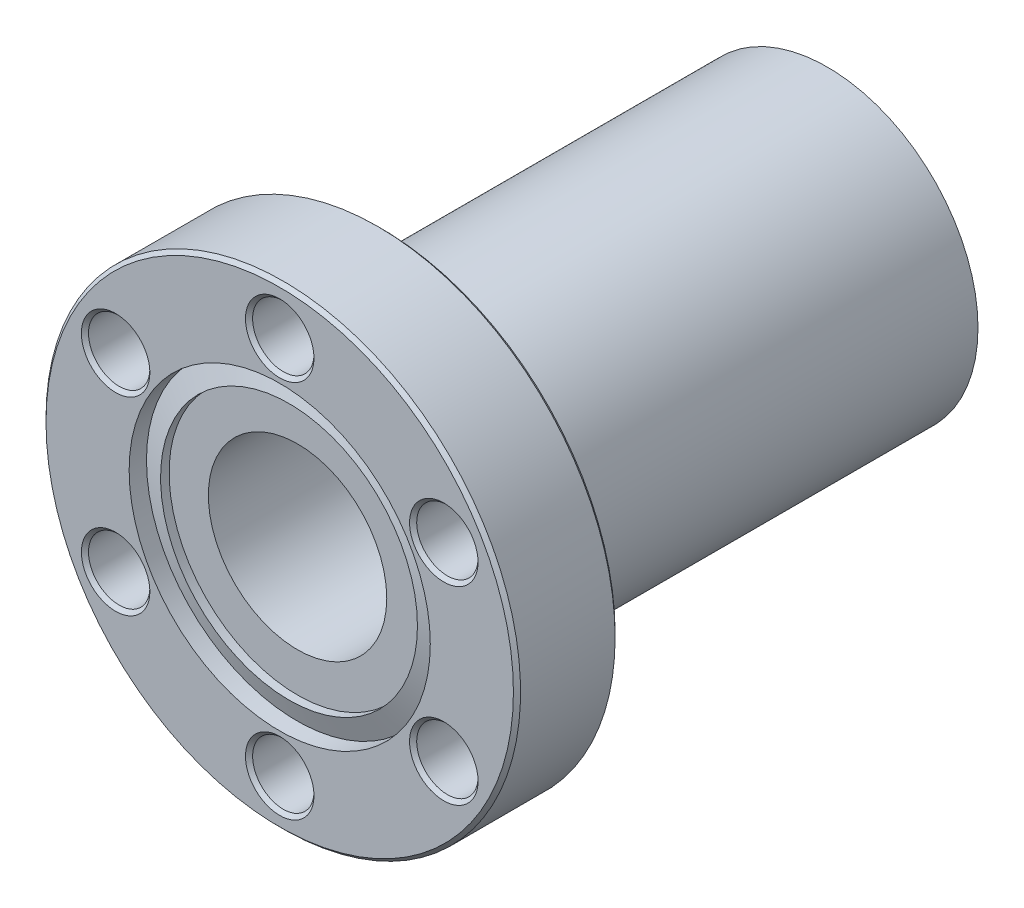
ISO-10303-21;
HEADER;
FILE_DESCRIPTION(('STEP AP214'),'2;1');
FILE_NAME('part.step','',(''),(''),'','','');
FILE_SCHEMA(('AUTOMOTIVE_DESIGN { 1 0 10303 214 1 1 1 1 }'));
ENDSEC;
DATA;
#1=APPLICATION_CONTEXT('core data for automotive mechanical design processes');
#2=APPLICATION_PROTOCOL_DEFINITION('international standard','automotive_design',2000,#1);
#3=PRODUCT_CONTEXT('',#1,'mechanical');
#4=PRODUCT('Part','Part','',(#3));
#5=PRODUCT_RELATED_PRODUCT_CATEGORY('part','',(#4));
#6=PRODUCT_DEFINITION_FORMATION('','',#4);
#7=PRODUCT_DEFINITION_CONTEXT('part definition',#1,'design');
#8=PRODUCT_DEFINITION('design','',#6,#7);
#9=PRODUCT_DEFINITION_SHAPE('','',#8);
#10=(LENGTH_UNIT() NAMED_UNIT(*) SI_UNIT(.MILLI.,.METRE.));
#11=(NAMED_UNIT(*) PLANE_ANGLE_UNIT() SI_UNIT($,.RADIAN.));
#12=(NAMED_UNIT(*) SI_UNIT($,.STERADIAN.) SOLID_ANGLE_UNIT());
#13=UNCERTAINTY_MEASURE_WITH_UNIT(LENGTH_MEASURE(1.E-05),#10,'distance_accuracy_value','');
#14=(GEOMETRIC_REPRESENTATION_CONTEXT(3) GLOBAL_UNCERTAINTY_ASSIGNED_CONTEXT((#13)) GLOBAL_UNIT_ASSIGNED_CONTEXT((#10,
#11,#12)) REPRESENTATION_CONTEXT('',''));
#15=CARTESIAN_POINT('',(0.,0.,0.));
#16=DIRECTION('',(0.,0.,1.));
#17=DIRECTION('',(1.,0.,0.));
#18=AXIS2_PLACEMENT_3D('',#15,#16,#17);
#19=CARTESIAN_POINT('',(0.,0.,-7.239));
#20=DIRECTION('',(0.,0.,-1.));
#21=DIRECTION('',(-1.,0.,0.));
#22=AXIS2_PLACEMENT_3D('',#19,#20,#21);
#23=PLANE('',#22);
#24=CARTESIAN_POINT('',(0.,0.,-7.23900000000002));
#25=DIRECTION('',(0.,0.,1.));
#26=DIRECTION('',(1.,0.,0.));
#27=AXIS2_PLACEMENT_3D('',#24,#25,#26);
#28=CIRCLE('',#27,16.637);
#29=CARTESIAN_POINT('',(16.637,0.,-7.23900000000002));
#30=VERTEX_POINT('',#29);
#31=EDGE_CURVE('E62',#30,#30,#28,.F.);
#32=ORIENTED_EDGE('',*,*,#31,.T.);
#33=EDGE_LOOP('',(#32));
#34=FACE_BOUND('',#33,.T.);
#35=CARTESIAN_POINT('',(0.,13.4874,-7.23899999997002));
#36=DIRECTION('',(0.,0.,-1.));
#37=DIRECTION('',(-1.,0.,0.));
#38=AXIS2_PLACEMENT_3D('',#35,#36,#37);
#39=CIRCLE('',#38,2.43839999990314);
#40=CARTESIAN_POINT('',(-2.43839999990314,13.4874,-7.23899999997002));
#41=VERTEX_POINT('',#40);
#42=EDGE_CURVE('E59',#41,#41,#39,.F.);
#43=ORIENTED_EDGE('',*,*,#42,.T.);
#44=EDGE_LOOP('',(#43));
#45=FACE_BOUND('',#44,.T.);
#46=CARTESIAN_POINT('',(11.6804310310013,6.7437,-7.23899999997002));
#47=DIRECTION('',(0.,0.,-1.));
#48=DIRECTION('',(-1.,0.,0.));
#49=AXIS2_PLACEMENT_3D('',#46,#47,#48);
#50=CIRCLE('',#49,2.43839999992273);
#51=CARTESIAN_POINT('',(9.24203103107857,6.7437,-7.23899999997002));
#52=VERTEX_POINT('',#51);
#53=EDGE_CURVE('E56',#52,#52,#50,.F.);
#54=ORIENTED_EDGE('',*,*,#53,.T.);
#55=EDGE_LOOP('',(#54));
#56=FACE_BOUND('',#55,.T.);
#57=CARTESIAN_POINT('',(11.6804310310013,-6.7437,-7.23899999997002));
#58=DIRECTION('',(0.,0.,-1.));
#59=DIRECTION('',(-1.,0.,0.));
#60=AXIS2_PLACEMENT_3D('',#57,#58,#59);
#61=CIRCLE('',#60,2.43839999992273);
#62=CARTESIAN_POINT('',(9.24203103107857,-6.7437,-7.23899999997002));
#63=VERTEX_POINT('',#62);
#64=EDGE_CURVE('E53',#63,#63,#61,.F.);
#65=ORIENTED_EDGE('',*,*,#64,.T.);
#66=EDGE_LOOP('',(#65));
#67=FACE_BOUND('',#66,.T.);
#68=CARTESIAN_POINT('',(0.,-13.4874,-7.23899999997002));
#69=DIRECTION('',(0.,0.,-1.));
#70=DIRECTION('',(-1.,0.,0.));
#71=AXIS2_PLACEMENT_3D('',#68,#69,#70);
#72=CIRCLE('',#71,2.43839999990314);
#73=CARTESIAN_POINT('',(-2.43839999990314,-13.4874,-7.23899999997002));
#74=VERTEX_POINT('',#73);
#75=EDGE_CURVE('E45',#74,#74,#72,.F.);
#76=ORIENTED_EDGE('',*,*,#75,.T.);
#77=EDGE_LOOP('',(#76));
#78=FACE_BOUND('',#77,.T.);
#79=CARTESIAN_POINT('',(-11.6804310310013,-6.7437,-7.23900000008371));
#80=DIRECTION('',(0.,0.,-1.));
#81=DIRECTION('',(0.,1.,0.));
#82=AXIS2_PLACEMENT_3D('',#79,#80,#81);
#83=CIRCLE('',#82,2.43839999999724);
#84=CARTESIAN_POINT('',(-11.6804310310013,-4.30530000000276,-7.23900000008371));
#85=VERTEX_POINT('',#84);
#86=EDGE_CURVE('E40',#85,#85,#83,.F.);
#87=ORIENTED_EDGE('',*,*,#86,.T.);
#88=EDGE_LOOP('',(#87));
#89=FACE_BOUND('',#88,.T.);
#90=CARTESIAN_POINT('',(-11.6804310310013,6.7437,-7.23900000008371));
#91=DIRECTION('',(0.,0.,-1.));
#92=DIRECTION('',(0.,1.,0.));
#93=AXIS2_PLACEMENT_3D('',#90,#91,#92);
#94=CIRCLE('',#93,2.43839999999724);
#95=CARTESIAN_POINT('',(-11.6804310310013,9.18209999999723,-7.23900000008371));
#96=VERTEX_POINT('',#95);
#97=EDGE_CURVE('E10',#96,#96,#94,.F.);
#98=ORIENTED_EDGE('',*,*,#97,.T.);
#99=EDGE_LOOP('',(#98));
#100=FACE_BOUND('',#99,.T.);
#101=CARTESIAN_POINT('',(0.,0.,-7.239));
#102=DIRECTION('',(0.,0.,-1.));
#103=DIRECTION('',(-1.,0.,0.));
#104=AXIS2_PLACEMENT_3D('',#101,#102,#103);
#105=CIRCLE('',#104,10.7188);
#106=CARTESIAN_POINT('',(-10.7188,0.,-7.239));
#107=VERTEX_POINT('',#106);
#108=EDGE_CURVE('E137',#107,#107,#105,.T.);
#109=ORIENTED_EDGE('',*,*,#108,.F.);
#110=EDGE_LOOP('',(#109));
#111=FACE_BOUND('',#110,.T.);
#112=ADVANCED_FACE('F32',(#34,#45,#56,#67,#78,#89,#100,#111),#23,.T.);
#113=CARTESIAN_POINT('',(0.,0.,-1.27));
#114=DIRECTION('',(0.,0.,1.));
#115=DIRECTION('',(1.,0.,0.));
#116=AXIS2_PLACEMENT_3D('',#113,#114,#115);
#117=PLANE('',#116);
#118=CARTESIAN_POINT('',(0.,0.,-1.27));
#119=DIRECTION('',(0.,0.,1.));
#120=DIRECTION('',(1.,0.,0.));
#121=AXIS2_PLACEMENT_3D('',#118,#119,#120);
#122=CIRCLE('',#121,6.35);
#123=CARTESIAN_POINT('',(6.35,0.,-1.27));
#124=VERTEX_POINT('',#123);
#125=EDGE_CURVE('E144',#124,#124,#122,.T.);
#126=ORIENTED_EDGE('',*,*,#125,.F.);
#127=EDGE_LOOP('',(#126));
#128=FACE_BOUND('',#127,.T.);
#129=CARTESIAN_POINT('',(0.,0.,-1.27));
#130=DIRECTION('',(0.,0.,1.));
#131=DIRECTION('',(1.,0.,0.));
#132=AXIS2_PLACEMENT_3D('',#129,#130,#131);
#133=CIRCLE('',#132,9.144);
#134=CARTESIAN_POINT('',(9.144,0.,-1.27));
#135=VERTEX_POINT('',#134);
#136=EDGE_CURVE('E36',#135,#135,#133,.T.);
#137=ORIENTED_EDGE('',*,*,#136,.T.);
#138=EDGE_LOOP('',(#137));
#139=FACE_BOUND('',#138,.T.);
#140=ADVANCED_FACE('F34',(#128,#139),#117,.T.);
#141=CARTESIAN_POINT('',(0.,0.,-1.3335));
#142=DIRECTION('',(0.,0.,1.));
#143=DIRECTION('',(1.,0.,0.));
#144=AXIS2_PLACEMENT_3D('',#141,#142,#143);
#145=CYLINDRICAL_SURFACE('',#144,9.144);
#146=CARTESIAN_POINT('',(0.,0.,-0.660399999999767));
#147=DIRECTION('',(0.,0.,-1.));
#148=DIRECTION('',(0.,-1.,0.));
#149=AXIS2_PLACEMENT_3D('',#146,#147,#148);
#150=CIRCLE('',#149,9.14400000000008);
#151=CARTESIAN_POINT('',(0.,-9.14400000000008,-0.660399999999767));
#152=VERTEX_POINT('',#151);
#153=EDGE_CURVE('E48',#152,#152,#150,.T.);
#154=ORIENTED_EDGE('',*,*,#153,.F.);
#155=EDGE_LOOP('',(#154));
#156=FACE_BOUND('',#155,.T.);
#157=ORIENTED_EDGE('',*,*,#136,.F.);
#158=EDGE_LOOP('',(#157));
#159=FACE_BOUND('',#158,.T.);
#160=ADVANCED_FACE('F161',(#156,#159),#145,.F.);
#161=CARTESIAN_POINT('',(0.,0.,-1.23358032492253));
#162=DIRECTION('',(0.,0.,-1.));
#163=DIRECTION('',(-1.,0.,0.));
#164=AXIS2_PLACEMENT_3D('',#161,#162,#163);
#165=CONICAL_SURFACE('',#164,10.7187999999999,1.2217304763958);
#166=CARTESIAN_POINT('',(0.,0.,-1.2335803249223));
#167=DIRECTION('',(0.,0.,1.));
#168=DIRECTION('',(1.,0.,0.));
#169=AXIS2_PLACEMENT_3D('',#166,#167,#168);
#170=CIRCLE('',#169,10.7188);
#171=CARTESIAN_POINT('',(10.7188,0.,-1.2335803249223));
#172=VERTEX_POINT('',#171);
#173=EDGE_CURVE('E89',#172,#172,#170,.T.);
#174=ORIENTED_EDGE('',*,*,#173,.T.);
#175=EDGE_LOOP('',(#174));
#176=FACE_BOUND('',#175,.T.);
#177=ORIENTED_EDGE('',*,*,#153,.T.);
#178=EDGE_LOOP('',(#177));
#179=FACE_BOUND('',#178,.T.);
#180=ADVANCED_FACE('F167',(#176,#179),#165,.T.);
#181=CARTESIAN_POINT('',(0.,0.,-1.3335));
#182=DIRECTION('',(0.,0.,1.));
#183=DIRECTION('',(1.,0.,0.));
#184=AXIS2_PLACEMENT_3D('',#181,#182,#183);
#185=CYLINDRICAL_SURFACE('',#184,10.7188);
#186=ORIENTED_EDGE('',*,*,#173,.F.);
#187=EDGE_LOOP('',(#186));
#188=FACE_BOUND('',#187,.T.);
#189=CARTESIAN_POINT('',(0.,0.,0.));
#190=DIRECTION('',(0.,0.,1.));
#191=DIRECTION('',(1.,0.,0.));
#192=AXIS2_PLACEMENT_3D('',#189,#190,#191);
#193=CIRCLE('',#192,10.7188);
#194=CARTESIAN_POINT('',(10.7188,0.,0.));
#195=VERTEX_POINT('',#194);
#196=EDGE_CURVE('E87',#195,#195,#193,.T.);
#197=ORIENTED_EDGE('',*,*,#196,.T.);
#198=EDGE_LOOP('',(#197));
#199=FACE_BOUND('',#198,.T.);
#200=ADVANCED_FACE('F172',(#188,#199),#185,.F.);
#201=CARTESIAN_POINT('',(0.,0.,0.));
#202=DIRECTION('',(0.,0.,-1.));
#203=DIRECTION('',(-1.,0.,0.));
#204=AXIS2_PLACEMENT_3D('',#201,#202,#203);
#205=PLANE('',#204);
#206=CARTESIAN_POINT('',(-11.6804310310013,6.7437,5.6843418860808E-11));
#207=DIRECTION('',(0.,0.,1.));
#208=DIRECTION('',(1.,0.,0.));
#209=AXIS2_PLACEMENT_3D('',#206,#207,#208);
#210=CIRCLE('',#209,2.43840000009326);
#211=CARTESIAN_POINT('',(-9.24203103090804,6.7437,5.6843418860808E-11));
#212=VERTEX_POINT('',#211);
#213=EDGE_CURVE('E66',#212,#212,#210,.F.);
#214=ORIENTED_EDGE('',*,*,#213,.T.);
#215=EDGE_LOOP('',(#214));
#216=FACE_BOUND('',#215,.T.);
#217=CARTESIAN_POINT('',(-11.6804310310013,-6.7437,5.6843418860808E-11));
#218=DIRECTION('',(0.,0.,1.));
#219=DIRECTION('',(1.,0.,0.));
#220=AXIS2_PLACEMENT_3D('',#217,#218,#219);
#221=CIRCLE('',#220,2.43840000009326);
#222=CARTESIAN_POINT('',(-9.24203103090804,-6.7437,5.6843418860808E-11));
#223=VERTEX_POINT('',#222);
#224=EDGE_CURVE('E70',#223,#223,#221,.F.);
#225=ORIENTED_EDGE('',*,*,#224,.T.);
#226=EDGE_LOOP('',(#225));
#227=FACE_BOUND('',#226,.T.);
#228=CARTESIAN_POINT('',(0.,-13.4874,5.6843418860808E-11));
#229=DIRECTION('',(0.,0.,1.));
#230=DIRECTION('',(1.,0.,0.));
#231=AXIS2_PLACEMENT_3D('',#228,#229,#230);
#232=CIRCLE('',#231,2.43840000001683);
#233=CARTESIAN_POINT('',(2.43840000001683,-13.4874,5.6843418860808E-11));
#234=VERTEX_POINT('',#233);
#235=EDGE_CURVE('E73',#234,#234,#232,.F.);
#236=ORIENTED_EDGE('',*,*,#235,.T.);
#237=EDGE_LOOP('',(#236));
#238=FACE_BOUND('',#237,.T.);
#239=CARTESIAN_POINT('',(11.6804310310013,-6.7437,5.6843418860808E-11));
#240=DIRECTION('',(0.,0.,1.));
#241=DIRECTION('',(1.,0.,0.));
#242=AXIS2_PLACEMENT_3D('',#239,#240,#241);
#243=CIRCLE('',#242,2.43839999999724);
#244=CARTESIAN_POINT('',(14.1188310309985,-6.7437,5.6843418860808E-11));
#245=VERTEX_POINT('',#244);
#246=EDGE_CURVE('E76',#245,#245,#243,.F.);
#247=ORIENTED_EDGE('',*,*,#246,.T.);
#248=EDGE_LOOP('',(#247));
#249=FACE_BOUND('',#248,.T.);
#250=CARTESIAN_POINT('',(11.6804310310013,6.7437,5.6843418860808E-11));
#251=DIRECTION('',(0.,0.,1.));
#252=DIRECTION('',(1.,0.,0.));
#253=AXIS2_PLACEMENT_3D('',#250,#251,#252);
#254=CIRCLE('',#253,2.43839999999724);
#255=CARTESIAN_POINT('',(14.1188310309985,6.7437,5.6843418860808E-11));
#256=VERTEX_POINT('',#255);
#257=EDGE_CURVE('E79',#256,#256,#254,.F.);
#258=ORIENTED_EDGE('',*,*,#257,.T.);
#259=EDGE_LOOP('',(#258));
#260=FACE_BOUND('',#259,.T.);
#261=CARTESIAN_POINT('',(0.,13.4874,5.6843418860808E-11));
#262=DIRECTION('',(0.,0.,1.));
#263=DIRECTION('',(1.,0.,0.));
#264=AXIS2_PLACEMENT_3D('',#261,#262,#263);
#265=CIRCLE('',#264,2.43840000001683);
#266=CARTESIAN_POINT('',(2.43840000001683,13.4874,5.6843418860808E-11));
#267=VERTEX_POINT('',#266);
#268=EDGE_CURVE('E82',#267,#267,#265,.F.);
#269=ORIENTED_EDGE('',*,*,#268,.T.);
#270=EDGE_LOOP('',(#269));
#271=FACE_BOUND('',#270,.T.);
#272=ORIENTED_EDGE('',*,*,#196,.F.);
#273=EDGE_LOOP('',(#272));
#274=FACE_BOUND('',#273,.T.);
#275=CARTESIAN_POINT('',(0.,0.,0.));
#276=DIRECTION('',(0.,0.,-1.));
#277=DIRECTION('',(-1.,0.,0.));
#278=AXIS2_PLACEMENT_3D('',#275,#276,#277);
#279=CIRCLE('',#278,16.637);
#280=CARTESIAN_POINT('',(-16.637,0.,0.));
#281=VERTEX_POINT('',#280);
#282=EDGE_CURVE('E85',#281,#281,#279,.T.);
#283=ORIENTED_EDGE('',*,*,#282,.F.);
#284=EDGE_LOOP('',(#283));
#285=FACE_BOUND('',#284,.T.);
#286=ADVANCED_FACE('F272',(#216,#227,#238,#249,#260,#271,#274,#285),#205,.F.);
#287=CARTESIAN_POINT('',(0.,0.,-0.254000000000019));
#288=DIRECTION('',(0.,0.,-1.));
#289=DIRECTION('',(-1.,0.,0.));
#290=AXIS2_PLACEMENT_3D('',#287,#288,#289);
#291=CONICAL_SURFACE('',#290,16.891,0.785398163397301);
#292=CARTESIAN_POINT('',(0.,0.,-0.254));
#293=DIRECTION('',(0.,0.,-1.));
#294=DIRECTION('',(-1.,0.,0.));
#295=AXIS2_PLACEMENT_3D('',#292,#293,#294);
#296=CIRCLE('',#295,16.891);
#297=CARTESIAN_POINT('',(-16.891,0.,-0.254));
#298=VERTEX_POINT('',#297);
#299=EDGE_CURVE('E69',#298,#298,#296,.T.);
#300=ORIENTED_EDGE('',*,*,#299,.F.);
#301=EDGE_LOOP('',(#300));
#302=FACE_BOUND('',#301,.T.);
#303=ORIENTED_EDGE('',*,*,#282,.T.);
#304=EDGE_LOOP('',(#303));
#305=FACE_BOUND('',#304,.T.);
#306=ADVANCED_FACE('F268',(#302,#305),#291,.T.);
#307=CARTESIAN_POINT('',(0.,13.4874,-5.6843418860808E-11));
#308=DIRECTION('',(0.,0.,1.));
#309=DIRECTION('',(1.,0.,0.));
#310=AXIS2_PLACEMENT_3D('',#307,#308,#309);
#311=CONICAL_SURFACE('',#310,2.43839999990314,0.785398163397448);
#312=CARTESIAN_POINT('',(0.,13.4874,-0.254));
#313=DIRECTION('',(0.,0.,-1.));
#314=DIRECTION('',(-1.,0.,0.));
#315=AXIS2_PLACEMENT_3D('',#312,#313,#314);
#316=CIRCLE('',#315,2.1844);
#317=CARTESIAN_POINT('',(-2.1844,13.4874,-0.254));
#318=VERTEX_POINT('',#317);
#319=EDGE_CURVE('E99',#318,#318,#316,.T.);
#320=ORIENTED_EDGE('',*,*,#319,.T.);
#321=EDGE_LOOP('',(#320));
#322=FACE_BOUND('',#321,.T.);
#323=ORIENTED_EDGE('',*,*,#268,.F.);
#324=EDGE_LOOP('',(#323));
#325=FACE_BOUND('',#324,.T.);
#326=ADVANCED_FACE('F264',(#322,#325),#311,.F.);
#327=CARTESIAN_POINT('',(11.6804310310013,6.7437,0.));
#328=DIRECTION('',(0.,0.,1.));
#329=DIRECTION('',(1.,0.,0.));
#330=AXIS2_PLACEMENT_3D('',#327,#328,#329);
#331=CONICAL_SURFACE('',#330,2.43839999994039,0.785398163397448);
#332=CARTESIAN_POINT('',(11.6804310310013,6.7437,-0.254));
#333=DIRECTION('',(0.,0.,-1.));
#334=DIRECTION('',(-1.,0.,0.));
#335=AXIS2_PLACEMENT_3D('',#332,#333,#334);
#336=CIRCLE('',#335,2.1844);
#337=CARTESIAN_POINT('',(9.4960310310013,6.7437,-0.254));
#338=VERTEX_POINT('',#337);
#339=EDGE_CURVE('E102',#338,#338,#336,.T.);
#340=ORIENTED_EDGE('',*,*,#339,.T.);
#341=EDGE_LOOP('',(#340));
#342=FACE_BOUND('',#341,.T.);
#343=ORIENTED_EDGE('',*,*,#257,.F.);
#344=EDGE_LOOP('',(#343));
#345=FACE_BOUND('',#344,.T.);
#346=ADVANCED_FACE('F260',(#342,#345),#331,.F.);
#347=CARTESIAN_POINT('',(11.6804310310013,-6.7437,0.));
#348=DIRECTION('',(0.,0.,1.));
#349=DIRECTION('',(1.,0.,0.));
#350=AXIS2_PLACEMENT_3D('',#347,#348,#349);
#351=CONICAL_SURFACE('',#350,2.43839999994039,0.785398163397448);
#352=CARTESIAN_POINT('',(11.6804310310013,-6.7437,-0.254));
#353=DIRECTION('',(0.,0.,-1.));
#354=DIRECTION('',(-1.,0.,0.));
#355=AXIS2_PLACEMENT_3D('',#352,#353,#354);
#356=CIRCLE('',#355,2.1844);
#357=CARTESIAN_POINT('',(9.4960310310013,-6.7437,-0.254));
#358=VERTEX_POINT('',#357);
#359=EDGE_CURVE('E105',#358,#358,#356,.T.);
#360=ORIENTED_EDGE('',*,*,#359,.T.);
#361=EDGE_LOOP('',(#360));
#362=FACE_BOUND('',#361,.T.);
#363=ORIENTED_EDGE('',*,*,#246,.F.);
#364=EDGE_LOOP('',(#363));
#365=FACE_BOUND('',#364,.T.);
#366=ADVANCED_FACE('F256',(#362,#365),#351,.F.);
#367=CARTESIAN_POINT('',(0.,-13.4874,-5.6843418860808E-11));
#368=DIRECTION('',(0.,0.,1.));
#369=DIRECTION('',(1.,0.,0.));
#370=AXIS2_PLACEMENT_3D('',#367,#368,#369);
#371=CONICAL_SURFACE('',#370,2.43839999990314,0.785398163397448);
#372=CARTESIAN_POINT('',(0.,-13.4874,-0.254));
#373=DIRECTION('',(0.,0.,-1.));
#374=DIRECTION('',(-1.,0.,0.));
#375=AXIS2_PLACEMENT_3D('',#372,#373,#374);
#376=CIRCLE('',#375,2.1844);
#377=CARTESIAN_POINT('',(-2.1844,-13.4874,-0.254));
#378=VERTEX_POINT('',#377);
#379=EDGE_CURVE('E108',#378,#378,#376,.T.);
#380=ORIENTED_EDGE('',*,*,#379,.T.);
#381=EDGE_LOOP('',(#380));
#382=FACE_BOUND('',#381,.T.);
#383=ORIENTED_EDGE('',*,*,#235,.F.);
#384=EDGE_LOOP('',(#383));
#385=FACE_BOUND('',#384,.T.);
#386=ADVANCED_FACE('F252',(#382,#385),#371,.F.);
#387=CARTESIAN_POINT('',(-11.6804310310013,-6.7437,5.6843418860808E-11));
#388=DIRECTION('',(0.,0.,1.));
#389=DIRECTION('',(1.,0.,0.));
#390=AXIS2_PLACEMENT_3D('',#387,#388,#389);
#391=CONICAL_SURFACE('',#390,2.43840000009326,0.785398163397448);
#392=CARTESIAN_POINT('',(-11.6804310310013,-6.7437,-0.254));
#393=DIRECTION('',(0.,0.,-1.));
#394=DIRECTION('',(-1.,0.,0.));
#395=AXIS2_PLACEMENT_3D('',#392,#393,#394);
#396=CIRCLE('',#395,2.1844);
#397=CARTESIAN_POINT('',(-13.8648310310013,-6.7437,-0.254));
#398=VERTEX_POINT('',#397);
#399=EDGE_CURVE('E111',#398,#398,#396,.T.);
#400=ORIENTED_EDGE('',*,*,#399,.T.);
#401=EDGE_LOOP('',(#400));
#402=FACE_BOUND('',#401,.T.);
#403=ORIENTED_EDGE('',*,*,#224,.F.);
#404=EDGE_LOOP('',(#403));
#405=FACE_BOUND('',#404,.T.);
#406=ADVANCED_FACE('F248',(#402,#405),#391,.F.);
#407=CARTESIAN_POINT('',(-11.6804310310013,6.7437,5.6843418860808E-11));
#408=DIRECTION('',(0.,0.,1.));
#409=DIRECTION('',(1.,0.,0.));
#410=AXIS2_PLACEMENT_3D('',#407,#408,#409);
#411=CONICAL_SURFACE('',#410,2.43840000009326,0.785398163397448);
#412=CARTESIAN_POINT('',(-11.6804310310013,6.7437,-0.254));
#413=DIRECTION('',(0.,0.,-1.));
#414=DIRECTION('',(-1.,0.,0.));
#415=AXIS2_PLACEMENT_3D('',#412,#413,#414);
#416=CIRCLE('',#415,2.1844);
#417=CARTESIAN_POINT('',(-13.8648310310013,6.7437,-0.254));
#418=VERTEX_POINT('',#417);
#419=EDGE_CURVE('E114',#418,#418,#416,.T.);
#420=ORIENTED_EDGE('',*,*,#419,.T.);
#421=EDGE_LOOP('',(#420));
#422=FACE_BOUND('',#421,.T.);
#423=ORIENTED_EDGE('',*,*,#213,.F.);
#424=EDGE_LOOP('',(#423));
#425=FACE_BOUND('',#424,.T.);
#426=ADVANCED_FACE('F244',(#422,#425),#411,.F.);
#427=CARTESIAN_POINT('',(0.,0.,0.));
#428=DIRECTION('',(0.,0.,-1.));
#429=DIRECTION('',(-1.,0.,0.));
#430=AXIS2_PLACEMENT_3D('',#427,#428,#429);
#431=CYLINDRICAL_SURFACE('',#430,16.891);
#432=CARTESIAN_POINT('',(0.,0.,-6.98499999999998));
#433=DIRECTION('',(0.,0.,1.));
#434=DIRECTION('',(0.,1.,0.));
#435=AXIS2_PLACEMENT_3D('',#432,#433,#434);
#436=CIRCLE('',#435,16.891);
#437=CARTESIAN_POINT('',(0.,16.891,-6.98499999999998));
#438=VERTEX_POINT('',#437);
#439=EDGE_CURVE('E117',#438,#438,#436,.F.);
#440=ORIENTED_EDGE('',*,*,#439,.F.);
#441=EDGE_LOOP('',(#440));
#442=FACE_BOUND('',#441,.T.);
#443=ORIENTED_EDGE('',*,*,#299,.T.);
#444=EDGE_LOOP('',(#443));
#445=FACE_BOUND('',#444,.T.);
#446=ADVANCED_FACE('F240',(#442,#445),#431,.T.);
#447=CARTESIAN_POINT('',(0.,13.4874,0.));
#448=DIRECTION('',(0.,0.,-1.));
#449=DIRECTION('',(-1.,0.,0.));
#450=AXIS2_PLACEMENT_3D('',#447,#448,#449);
#451=CYLINDRICAL_SURFACE('',#450,2.1844);
#452=CARTESIAN_POINT('',(0.,13.4874,-6.98499999998603));
#453=DIRECTION('',(0.,0.,-1.));
#454=DIRECTION('',(-1.,0.,0.));
#455=AXIS2_PLACEMENT_3D('',#452,#453,#454);
#456=CIRCLE('',#455,2.18439999991915);
#457=CARTESIAN_POINT('',(-2.18439999991915,13.4874,-6.98499999998603));
#458=VERTEX_POINT('',#457);
#459=EDGE_CURVE('E120',#458,#458,#456,.T.);
#460=ORIENTED_EDGE('',*,*,#459,.T.);
#461=EDGE_LOOP('',(#460));
#462=FACE_BOUND('',#461,.T.);
#463=ORIENTED_EDGE('',*,*,#319,.F.);
#464=EDGE_LOOP('',(#463));
#465=FACE_BOUND('',#464,.T.);
#466=ADVANCED_FACE('F236',(#462,#465),#451,.F.);
#467=CARTESIAN_POINT('',(11.6804310310013,6.7437,0.));
#468=DIRECTION('',(0.,0.,-1.));
#469=DIRECTION('',(-1.,0.,0.));
#470=AXIS2_PLACEMENT_3D('',#467,#468,#469);
#471=CYLINDRICAL_SURFACE('',#470,2.1844);
#472=CARTESIAN_POINT('',(11.6804310310013,6.7437,-6.98499999998603));
#473=DIRECTION('',(0.,0.,-1.));
#474=DIRECTION('',(-1.,0.,0.));
#475=AXIS2_PLACEMENT_3D('',#472,#473,#474);
#476=CIRCLE('',#475,2.18439999993874);
#477=CARTESIAN_POINT('',(9.49603103106256,6.7437,-6.98499999998603));
#478=VERTEX_POINT('',#477);
#479=EDGE_CURVE('E123',#478,#478,#476,.T.);
#480=ORIENTED_EDGE('',*,*,#479,.T.);
#481=EDGE_LOOP('',(#480));
#482=FACE_BOUND('',#481,.T.);
#483=ORIENTED_EDGE('',*,*,#339,.F.);
#484=EDGE_LOOP('',(#483));
#485=FACE_BOUND('',#484,.T.);
#486=ADVANCED_FACE('F232',(#482,#485),#471,.F.);
#487=CARTESIAN_POINT('',(11.6804310310013,-6.7437,0.));
#488=DIRECTION('',(0.,0.,-1.));
#489=DIRECTION('',(-1.,0.,0.));
#490=AXIS2_PLACEMENT_3D('',#487,#488,#489);
#491=CYLINDRICAL_SURFACE('',#490,2.1844);
#492=CARTESIAN_POINT('',(11.6804310310013,-6.7437,-6.98499999998603));
#493=DIRECTION('',(0.,0.,-1.));
#494=DIRECTION('',(-1.,0.,0.));
#495=AXIS2_PLACEMENT_3D('',#492,#493,#494);
#496=CIRCLE('',#495,2.18439999993874);
#497=CARTESIAN_POINT('',(9.49603103106256,-6.7437,-6.98499999998603));
#498=VERTEX_POINT('',#497);
#499=EDGE_CURVE('E126',#498,#498,#496,.T.);
#500=ORIENTED_EDGE('',*,*,#499,.T.);
#501=EDGE_LOOP('',(#500));
#502=FACE_BOUND('',#501,.T.);
#503=ORIENTED_EDGE('',*,*,#359,.F.);
#504=EDGE_LOOP('',(#503));
#505=FACE_BOUND('',#504,.T.);
#506=ADVANCED_FACE('F228',(#502,#505),#491,.F.);
#507=CARTESIAN_POINT('',(0.,-13.4874,0.));
#508=DIRECTION('',(0.,0.,-1.));
#509=DIRECTION('',(-1.,0.,0.));
#510=AXIS2_PLACEMENT_3D('',#507,#508,#509);
#511=CYLINDRICAL_SURFACE('',#510,2.1844);
#512=CARTESIAN_POINT('',(0.,-13.4874,-6.98499999998603));
#513=DIRECTION('',(0.,0.,-1.));
#514=DIRECTION('',(-1.,0.,0.));
#515=AXIS2_PLACEMENT_3D('',#512,#513,#514);
#516=CIRCLE('',#515,2.18439999991915);
#517=CARTESIAN_POINT('',(-2.18439999991915,-13.4874,-6.98499999998603));
#518=VERTEX_POINT('',#517);
#519=EDGE_CURVE('E129',#518,#518,#516,.T.);
#520=ORIENTED_EDGE('',*,*,#519,.T.);
#521=EDGE_LOOP('',(#520));
#522=FACE_BOUND('',#521,.T.);
#523=ORIENTED_EDGE('',*,*,#379,.F.);
#524=EDGE_LOOP('',(#523));
#525=FACE_BOUND('',#524,.T.);
#526=ADVANCED_FACE('F224',(#522,#525),#511,.F.);
#527=CARTESIAN_POINT('',(-11.6804310310013,-6.7437,0.));
#528=DIRECTION('',(0.,0.,-1.));
#529=DIRECTION('',(-1.,0.,0.));
#530=AXIS2_PLACEMENT_3D('',#527,#528,#529);
#531=CYLINDRICAL_SURFACE('',#530,2.1844);
#532=CARTESIAN_POINT('',(-11.6804310310013,-6.7437,-6.98500000004287));
#533=DIRECTION('',(0.,0.,-1.));
#534=DIRECTION('',(-1.,0.,0.));
#535=AXIS2_PLACEMENT_3D('',#532,#533,#534);
#536=CIRCLE('',#535,2.1843999999564);
#537=CARTESIAN_POINT('',(-13.8648310309577,-6.7437,-6.98500000004287));
#538=VERTEX_POINT('',#537);
#539=EDGE_CURVE('E132',#538,#538,#536,.T.);
#540=ORIENTED_EDGE('',*,*,#539,.T.);
#541=EDGE_LOOP('',(#540));
#542=FACE_BOUND('',#541,.T.);
#543=ORIENTED_EDGE('',*,*,#399,.F.);
#544=EDGE_LOOP('',(#543));
#545=FACE_BOUND('',#544,.T.);
#546=ADVANCED_FACE('F220',(#542,#545),#531,.F.);
#547=CARTESIAN_POINT('',(-11.6804310310013,6.7437,0.));
#548=DIRECTION('',(0.,0.,-1.));
#549=DIRECTION('',(-1.,0.,0.));
#550=AXIS2_PLACEMENT_3D('',#547,#548,#549);
#551=CYLINDRICAL_SURFACE('',#550,2.1844);
#552=CARTESIAN_POINT('',(-11.6804310310013,6.7437,-6.98500000004287));
#553=DIRECTION('',(0.,0.,-1.));
#554=DIRECTION('',(-1.,0.,0.));
#555=AXIS2_PLACEMENT_3D('',#552,#553,#554);
#556=CIRCLE('',#555,2.1843999999564);
#557=CARTESIAN_POINT('',(-13.8648310309577,6.7437,-6.98500000004287));
#558=VERTEX_POINT('',#557);
#559=EDGE_CURVE('E65',#558,#558,#556,.T.);
#560=ORIENTED_EDGE('',*,*,#559,.T.);
#561=EDGE_LOOP('',(#560));
#562=FACE_BOUND('',#561,.T.);
#563=ORIENTED_EDGE('',*,*,#419,.F.);
#564=EDGE_LOOP('',(#563));
#565=FACE_BOUND('',#564,.T.);
#566=ADVANCED_FACE('F216',(#562,#565),#551,.F.);
#567=CARTESIAN_POINT('',(0.,0.,-6.98499999999998));
#568=DIRECTION('',(0.,0.,1.));
#569=DIRECTION('',(1.,0.,0.));
#570=AXIS2_PLACEMENT_3D('',#567,#568,#569);
#571=CONICAL_SURFACE('',#570,16.891,0.7853981633973);
#572=ORIENTED_EDGE('',*,*,#439,.T.);
#573=EDGE_LOOP('',(#572));
#574=FACE_BOUND('',#573,.T.);
#575=ORIENTED_EDGE('',*,*,#31,.F.);
#576=EDGE_LOOP('',(#575));
#577=FACE_BOUND('',#576,.T.);
#578=ADVANCED_FACE('F212',(#574,#577),#571,.T.);
#579=CARTESIAN_POINT('',(0.,13.4874,-7.23899999991318));
#580=DIRECTION('',(0.,0.,-1.));
#581=DIRECTION('',(-1.,0.,0.));
#582=AXIS2_PLACEMENT_3D('',#579,#580,#581);
#583=CONICAL_SURFACE('',#582,2.4383999998463,0.785398163397448);
#584=ORIENTED_EDGE('',*,*,#459,.F.);
#585=EDGE_LOOP('',(#584));
#586=FACE_BOUND('',#585,.T.);
#587=ORIENTED_EDGE('',*,*,#42,.F.);
#588=EDGE_LOOP('',(#587));
#589=FACE_BOUND('',#588,.T.);
#590=ADVANCED_FACE('F208',(#586,#589),#583,.F.);
#591=CARTESIAN_POINT('',(11.6804310310013,6.7437,-7.23899999991318));
#592=DIRECTION('',(0.,0.,-1.));
#593=DIRECTION('',(-1.,0.,0.));
#594=AXIS2_PLACEMENT_3D('',#591,#592,#593);
#595=CONICAL_SURFACE('',#594,2.43839999986589,0.785398163397448);
#596=ORIENTED_EDGE('',*,*,#479,.F.);
#597=EDGE_LOOP('',(#596));
#598=FACE_BOUND('',#597,.T.);
#599=ORIENTED_EDGE('',*,*,#53,.F.);
#600=EDGE_LOOP('',(#599));
#601=FACE_BOUND('',#600,.T.);
#602=ADVANCED_FACE('F204',(#598,#601),#595,.F.);
#603=CARTESIAN_POINT('',(11.6804310310013,-6.7437,-7.23899999991318));
#604=DIRECTION('',(0.,0.,-1.));
#605=DIRECTION('',(-1.,0.,0.));
#606=AXIS2_PLACEMENT_3D('',#603,#604,#605);
#607=CONICAL_SURFACE('',#606,2.43839999986589,0.785398163397448);
#608=ORIENTED_EDGE('',*,*,#499,.F.);
#609=EDGE_LOOP('',(#608));
#610=FACE_BOUND('',#609,.T.);
#611=ORIENTED_EDGE('',*,*,#64,.F.);
#612=EDGE_LOOP('',(#611));
#613=FACE_BOUND('',#612,.T.);
#614=ADVANCED_FACE('F200',(#610,#613),#607,.F.);
#615=CARTESIAN_POINT('',(0.,-13.4874,-7.23899999991318));
#616=DIRECTION('',(0.,0.,-1.));
#617=DIRECTION('',(-1.,0.,0.));
#618=AXIS2_PLACEMENT_3D('',#615,#616,#617);
#619=CONICAL_SURFACE('',#618,2.4383999998463,0.785398163397448);
#620=ORIENTED_EDGE('',*,*,#519,.F.);
#621=EDGE_LOOP('',(#620));
#622=FACE_BOUND('',#621,.T.);
#623=ORIENTED_EDGE('',*,*,#75,.F.);
#624=EDGE_LOOP('',(#623));
#625=FACE_BOUND('',#624,.T.);
#626=ADVANCED_FACE('F192',(#622,#625),#619,.F.);
#627=CARTESIAN_POINT('',(-11.6804310310013,-6.7437,-7.23900000002686));
#628=DIRECTION('',(0.,0.,-1.));
#629=DIRECTION('',(0.,1.,0.));
#630=AXIS2_PLACEMENT_3D('',#627,#628,#629);
#631=CONICAL_SURFACE('',#630,2.43839999994039,0.785398163397448);
#632=ORIENTED_EDGE('',*,*,#539,.F.);
#633=EDGE_LOOP('',(#632));
#634=FACE_BOUND('',#633,.T.);
#635=ORIENTED_EDGE('',*,*,#86,.F.);
#636=EDGE_LOOP('',(#635));
#637=FACE_BOUND('',#636,.T.);
#638=ADVANCED_FACE('F185',(#634,#637),#631,.F.);
#639=CARTESIAN_POINT('',(-11.6804310310013,6.7437,-7.23900000002686));
#640=DIRECTION('',(0.,0.,-1.));
#641=DIRECTION('',(0.,1.,0.));
#642=AXIS2_PLACEMENT_3D('',#639,#640,#641);
#643=CONICAL_SURFACE('',#642,2.43839999994039,0.785398163397448);
#644=ORIENTED_EDGE('',*,*,#559,.F.);
#645=EDGE_LOOP('',(#644));
#646=FACE_BOUND('',#645,.T.);
#647=ORIENTED_EDGE('',*,*,#97,.F.);
#648=EDGE_LOOP('',(#647));
#649=FACE_BOUND('',#648,.T.);
#650=ADVANCED_FACE('F178',(#646,#649),#643,.F.);
#651=CARTESIAN_POINT('',(0.,0.,-38.989));
#652=DIRECTION('',(0.,0.,1.));
#653=DIRECTION('',(1.,0.,0.));
#654=AXIS2_PLACEMENT_3D('',#651,#652,#653);
#655=CYLINDRICAL_SURFACE('',#654,10.7188);
#656=CARTESIAN_POINT('',(0.,0.,-38.989));
#657=DIRECTION('',(0.,0.,-1.));
#658=DIRECTION('',(-1.,0.,0.));
#659=AXIS2_PLACEMENT_3D('',#656,#657,#658);
#660=CIRCLE('',#659,10.7188);
#661=CARTESIAN_POINT('',(-10.7188,0.,-38.989));
#662=VERTEX_POINT('',#661);
#663=EDGE_CURVE('E140',#662,#662,#660,.T.);
#664=ORIENTED_EDGE('',*,*,#663,.F.);
#665=EDGE_LOOP('',(#664));
#666=FACE_BOUND('',#665,.T.);
#667=ORIENTED_EDGE('',*,*,#108,.T.);
#668=EDGE_LOOP('',(#667));
#669=FACE_BOUND('',#668,.T.);
#670=ADVANCED_FACE('F162',(#666,#669),#655,.T.);
#671=CARTESIAN_POINT('',(0.,0.,-38.989));
#672=DIRECTION('',(0.,0.,-1.));
#673=DIRECTION('',(-1.,0.,0.));
#674=AXIS2_PLACEMENT_3D('',#671,#672,#673);
#675=PLANE('',#674);
#676=CARTESIAN_POINT('',(0.,0.,-38.989));
#677=DIRECTION('',(0.,0.,1.));
#678=DIRECTION('',(1.,0.,0.));
#679=AXIS2_PLACEMENT_3D('',#676,#677,#678);
#680=CIRCLE('',#679,6.35);
#681=CARTESIAN_POINT('',(6.35,0.,-38.989));
#682=VERTEX_POINT('',#681);
#683=EDGE_CURVE('E141',#682,#682,#680,.T.);
#684=ORIENTED_EDGE('',*,*,#683,.T.);
#685=EDGE_LOOP('',(#684));
#686=FACE_BOUND('',#685,.T.);
#687=ORIENTED_EDGE('',*,*,#663,.T.);
#688=EDGE_LOOP('',(#687));
#689=FACE_BOUND('',#688,.T.);
#690=ADVANCED_FACE('F150',(#686,#689),#675,.T.);
#691=CARTESIAN_POINT('',(0.,0.,-38.989));
#692=DIRECTION('',(0.,0.,1.));
#693=DIRECTION('',(1.,0.,0.));
#694=AXIS2_PLACEMENT_3D('',#691,#692,#693);
#695=CYLINDRICAL_SURFACE('',#694,6.35);
#696=ORIENTED_EDGE('',*,*,#683,.F.);
#697=EDGE_LOOP('',(#696));
#698=FACE_BOUND('',#697,.T.);
#699=ORIENTED_EDGE('',*,*,#125,.T.);
#700=EDGE_LOOP('',(#699));
#701=FACE_BOUND('',#700,.T.);
#702=ADVANCED_FACE('F153',(#698,#701),#695,.F.);
#703=CLOSED_SHELL('',(#112,#140,#160,#180,#200,#286,#306,#326,#346,#366,#386,#406,#426,#446,
#466,#486,#506,#526,#546,#566,#578,#590,#602,#614,#626,#638,#650,#670,#690,#702));
#704=MANIFOLD_SOLID_BREP('B2',#703);
#705=ADVANCED_BREP_SHAPE_REPRESENTATION('',(#18,#704),#14);
#706=SHAPE_DEFINITION_REPRESENTATION(#9,#705);
ENDSEC;
END-ISO-10303-21;
